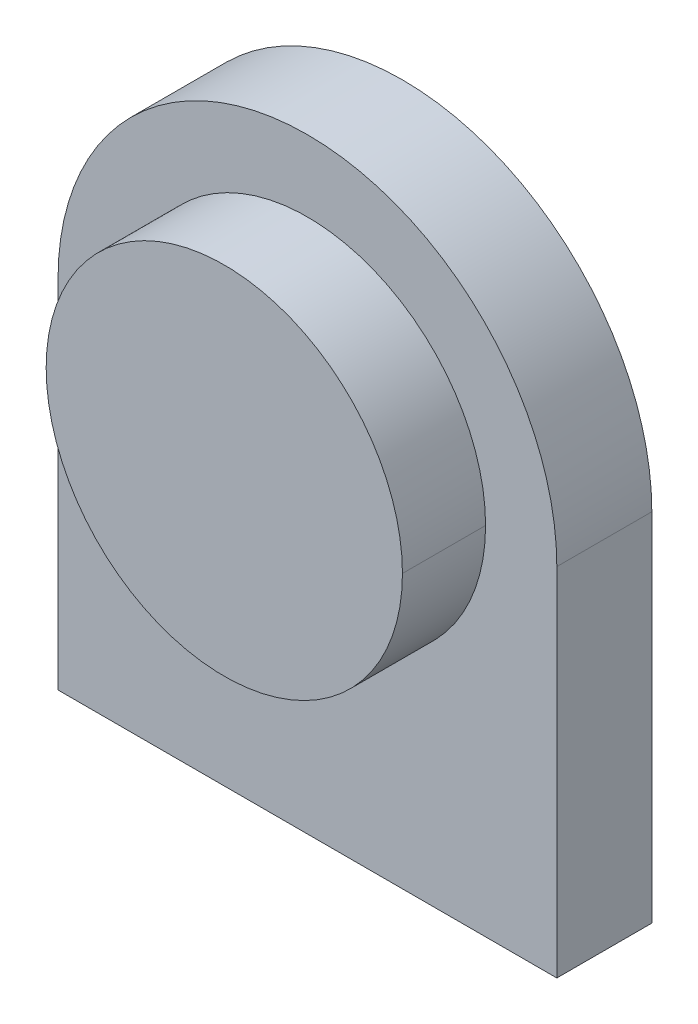
ISO-10303-21;
HEADER;
FILE_DESCRIPTION(('STEP AP214'),'2;1');
FILE_NAME('part.step','',(''),(''),'','','');
FILE_SCHEMA(('AUTOMOTIVE_DESIGN { 1 0 10303 214 1 1 1 1 }'));
ENDSEC;
DATA;
#1=APPLICATION_CONTEXT('core data for automotive mechanical design processes');
#2=APPLICATION_PROTOCOL_DEFINITION('international standard','automotive_design',2000,#1);
#3=PRODUCT_CONTEXT('',#1,'mechanical');
#4=PRODUCT('Part','Part','',(#3));
#5=PRODUCT_RELATED_PRODUCT_CATEGORY('part','',(#4));
#6=PRODUCT_DEFINITION_FORMATION('','',#4);
#7=PRODUCT_DEFINITION_CONTEXT('part definition',#1,'design');
#8=PRODUCT_DEFINITION('design','',#6,#7);
#9=PRODUCT_DEFINITION_SHAPE('','',#8);
#10=(LENGTH_UNIT() NAMED_UNIT(*) SI_UNIT(.MILLI.,.METRE.));
#11=(NAMED_UNIT(*) PLANE_ANGLE_UNIT() SI_UNIT($,.RADIAN.));
#12=(NAMED_UNIT(*) SI_UNIT($,.STERADIAN.) SOLID_ANGLE_UNIT());
#13=UNCERTAINTY_MEASURE_WITH_UNIT(LENGTH_MEASURE(1.E-05),#10,'distance_accuracy_value','');
#14=(GEOMETRIC_REPRESENTATION_CONTEXT(3) GLOBAL_UNCERTAINTY_ASSIGNED_CONTEXT((#13)) GLOBAL_UNIT_ASSIGNED_CONTEXT((#10,
#11,#12)) REPRESENTATION_CONTEXT('',''));
#15=CARTESIAN_POINT('',(0.,0.,0.));
#16=DIRECTION('',(0.,0.,1.));
#17=DIRECTION('',(1.,0.,0.));
#18=AXIS2_PLACEMENT_3D('',#15,#16,#17);
#19=CARTESIAN_POINT('',(0.,0.,5.));
#20=DIRECTION('',(0.,0.,-1.));
#21=DIRECTION('',(-1.,0.,0.));
#22=AXIS2_PLACEMENT_3D('',#19,#20,#21);
#23=CYLINDRICAL_SURFACE('',#22,7.5);
#24=DIRECTION('',(0.,0.,-1.));
#25=VECTOR('',#24,1.);
#26=CARTESIAN_POINT('',(-7.5,0.,5.));
#27=LINE('',#26,#25);
#28=CARTESIAN_POINT('',(-7.5,0.,3.5));
#29=VERTEX_POINT('',#28);
#30=CARTESIAN_POINT('',(-7.5,0.,0.));
#31=VERTEX_POINT('',#30);
#32=EDGE_CURVE('E167',#29,#31,#27,.T.);
#33=ORIENTED_EDGE('',*,*,#32,.F.);
#34=CARTESIAN_POINT('',(0.,0.,3.5));
#35=DIRECTION('',(0.,0.,1.));
#36=DIRECTION('',(1.,0.,0.));
#37=AXIS2_PLACEMENT_3D('',#34,#35,#36);
#38=CIRCLE('',#37,7.5);
#39=CARTESIAN_POINT('',(7.5,0.,3.5));
#40=VERTEX_POINT('',#39);
#41=EDGE_CURVE('E68',#40,#29,#38,.T.);
#42=ORIENTED_EDGE('',*,*,#41,.F.);
#43=DIRECTION('',(0.,0.,-1.));
#44=VECTOR('',#43,1.);
#45=CARTESIAN_POINT('',(7.5,0.,5.));
#46=LINE('',#45,#44);
#47=CARTESIAN_POINT('',(7.5,0.,0.));
#48=VERTEX_POINT('',#47);
#49=EDGE_CURVE('E101',#40,#48,#46,.T.);
#50=ORIENTED_EDGE('',*,*,#49,.T.);
#51=CARTESIAN_POINT('',(0.,0.,0.));
#52=DIRECTION('',(0.,0.,1.));
#53=DIRECTION('',(1.,0.,0.));
#54=AXIS2_PLACEMENT_3D('',#51,#52,#53);
#55=CIRCLE('',#54,7.5);
#56=EDGE_CURVE('E170',#48,#31,#55,.T.);
#57=ORIENTED_EDGE('',*,*,#56,.T.);
#58=EDGE_LOOP('',(#33,#42,#50,#57));
#59=FACE_BOUND('',#58,.T.);
#60=ADVANCED_FACE('F51',(#59),#23,.T.);
#61=CARTESIAN_POINT('',(0.,0.,5.));
#62=DIRECTION('',(0.,0.,-1.));
#63=DIRECTION('',(-1.,0.,0.));
#64=AXIS2_PLACEMENT_3D('',#61,#62,#63);
#65=CYLINDRICAL_SURFACE('',#64,7.5);
#66=ORIENTED_EDGE('',*,*,#49,.F.);
#67=EDGE_CURVE('E366',#29,#40,#38,.T.);
#68=ORIENTED_EDGE('',*,*,#67,.F.);
#69=ORIENTED_EDGE('',*,*,#32,.T.);
#70=CARTESIAN_POINT('',(0.,0.,0.));
#71=DIRECTION('',(0.,0.,1.));
#72=DIRECTION('',(1.,0.,0.));
#73=AXIS2_PLACEMENT_3D('',#70,#71,#72);
#74=CIRCLE('',#73,7.5);
#75=EDGE_CURVE('E125',#31,#48,#74,.T.);
#76=ORIENTED_EDGE('',*,*,#75,.T.);
#77=EDGE_LOOP('',(#66,#68,#69,#76));
#78=FACE_BOUND('',#77,.T.);
#79=ADVANCED_FACE('F269',(#78),#65,.T.);
#80=CARTESIAN_POINT('',(0.,0.,-4.));
#81=DIRECTION('',(0.,0.,1.));
#82=DIRECTION('',(1.,0.,0.));
#83=AXIS2_PLACEMENT_3D('',#80,#81,#82);
#84=CYLINDRICAL_SURFACE('',#83,10.5);
#85=CARTESIAN_POINT('',(0.,0.,-4.));
#86=DIRECTION('',(0.,0.,-1.));
#87=DIRECTION('',(-1.,0.,0.));
#88=AXIS2_PLACEMENT_3D('',#85,#86,#87);
#89=CIRCLE('',#88,10.5);
#90=CARTESIAN_POINT('',(-10.5,0.,-4.));
#91=VERTEX_POINT('',#90);
#92=CARTESIAN_POINT('',(10.5,0.,-4.));
#93=VERTEX_POINT('',#92);
#94=EDGE_CURVE('E55',#91,#93,#89,.T.);
#95=ORIENTED_EDGE('',*,*,#94,.F.);
#96=DIRECTION('',(0.,0.,1.));
#97=VECTOR('',#96,1.);
#98=CARTESIAN_POINT('',(-10.5,0.,-4.));
#99=LINE('',#98,#97);
#100=CARTESIAN_POINT('',(-10.5,0.,0.));
#101=VERTEX_POINT('',#100);
#102=EDGE_CURVE('E12',#91,#101,#99,.T.);
#103=ORIENTED_EDGE('',*,*,#102,.T.);
#104=CARTESIAN_POINT('',(0.,0.,0.));
#105=DIRECTION('',(0.,0.,-1.));
#106=DIRECTION('',(-1.,0.,0.));
#107=AXIS2_PLACEMENT_3D('',#104,#105,#106);
#108=CIRCLE('',#107,10.5);
#109=CARTESIAN_POINT('',(10.5,0.,0.));
#110=VERTEX_POINT('',#109);
#111=EDGE_CURVE('E61',#101,#110,#108,.T.);
#112=ORIENTED_EDGE('',*,*,#111,.T.);
#113=DIRECTION('',(0.,0.,1.));
#114=VECTOR('',#113,1.);
#115=CARTESIAN_POINT('',(10.5,0.,-4.));
#116=LINE('',#115,#114);
#117=EDGE_CURVE('E116',#93,#110,#116,.T.);
#118=ORIENTED_EDGE('',*,*,#117,.F.);
#119=EDGE_LOOP('',(#95,#103,#112,#118));
#120=FACE_BOUND('',#119,.T.);
#121=ADVANCED_FACE('F119',(#120),#84,.T.);
#122=CARTESIAN_POINT('',(0.,0.,-4.));
#123=DIRECTION('',(0.,0.,-1.));
#124=DIRECTION('',(0.,-1.,0.));
#125=AXIS2_PLACEMENT_3D('',#122,#123,#124);
#126=PLANE('',#125);
#127=CARTESIAN_POINT('',(0.,0.,-4.));
#128=DIRECTION('',(0.,0.,-1.));
#129=DIRECTION('',(0.,1.,0.));
#130=AXIS2_PLACEMENT_3D('',#127,#128,#129);
#131=CIRCLE('',#130,9.25);
#132=CARTESIAN_POINT('',(0.,9.25,-4.));
#133=VERTEX_POINT('',#132);
#134=EDGE_CURVE('E155',#133,#133,#131,.T.);
#135=ORIENTED_EDGE('',*,*,#134,.F.);
#136=EDGE_LOOP('',(#135));
#137=FACE_BOUND('',#136,.T.);
#138=ORIENTED_EDGE('',*,*,#94,.T.);
#139=DIRECTION('',(0.,1.,0.));
#140=VECTOR('',#139,1.);
#141=CARTESIAN_POINT('',(10.5,0.,-4.));
#142=LINE('',#141,#140);
#143=CARTESIAN_POINT('',(10.5,-15.,-4.));
#144=VERTEX_POINT('',#143);
#145=EDGE_CURVE('E111',#144,#93,#142,.T.);
#146=ORIENTED_EDGE('',*,*,#145,.F.);
#147=DIRECTION('',(-1.,0.,0.));
#148=VECTOR('',#147,1.);
#149=CARTESIAN_POINT('',(0.,-15.,-4.));
#150=LINE('',#149,#148);
#151=CARTESIAN_POINT('',(-10.5,-15.,-4.));
#152=VERTEX_POINT('',#151);
#153=EDGE_CURVE('E134',#144,#152,#150,.T.);
#154=ORIENTED_EDGE('',*,*,#153,.T.);
#155=DIRECTION('',(0.,1.,0.));
#156=VECTOR('',#155,1.);
#157=CARTESIAN_POINT('',(-10.5,0.,-4.));
#158=LINE('',#157,#156);
#159=EDGE_CURVE('E113',#152,#91,#158,.T.);
#160=ORIENTED_EDGE('',*,*,#159,.T.);
#161=EDGE_LOOP('',(#138,#146,#154,#160));
#162=FACE_BOUND('',#161,.T.);
#163=ADVANCED_FACE('F108',(#137,#162),#126,.T.);
#164=CARTESIAN_POINT('',(0.,0.,0.));
#165=DIRECTION('',(0.,0.,-1.));
#166=DIRECTION('',(0.,-1.,0.));
#167=AXIS2_PLACEMENT_3D('',#164,#165,#166);
#168=PLANE('',#167);
#169=ORIENTED_EDGE('',*,*,#111,.F.);
#170=DIRECTION('',(0.,1.,0.));
#171=VECTOR('',#170,1.);
#172=CARTESIAN_POINT('',(-10.5,0.,0.));
#173=LINE('',#172,#171);
#174=CARTESIAN_POINT('',(-10.5,-15.,0.));
#175=VERTEX_POINT('',#174);
#176=EDGE_CURVE('E143',#175,#101,#173,.T.);
#177=ORIENTED_EDGE('',*,*,#176,.F.);
#178=DIRECTION('',(-1.,0.,0.));
#179=VECTOR('',#178,1.);
#180=CARTESIAN_POINT('',(0.,-15.,0.));
#181=LINE('',#180,#179);
#182=CARTESIAN_POINT('',(10.5,-15.,0.));
#183=VERTEX_POINT('',#182);
#184=EDGE_CURVE('E147',#183,#175,#181,.T.);
#185=ORIENTED_EDGE('',*,*,#184,.F.);
#186=DIRECTION('',(0.,1.,0.));
#187=VECTOR('',#186,1.);
#188=CARTESIAN_POINT('',(10.5,0.,0.));
#189=LINE('',#188,#187);
#190=EDGE_CURVE('E151',#183,#110,#189,.T.);
#191=ORIENTED_EDGE('',*,*,#190,.T.);
#192=EDGE_LOOP('',(#169,#177,#185,#191));
#193=FACE_BOUND('',#192,.T.);
#194=ORIENTED_EDGE('',*,*,#75,.F.);
#195=ORIENTED_EDGE('',*,*,#56,.F.);
#196=EDGE_LOOP('',(#194,#195));
#197=FACE_BOUND('',#196,.T.);
#198=ADVANCED_FACE('F209',(#193,#197),#168,.F.);
#199=CARTESIAN_POINT('',(0.,0.,-4.));
#200=DIRECTION('',(0.,0.,-1.));
#201=DIRECTION('',(0.,1.,0.));
#202=AXIS2_PLACEMENT_3D('',#199,#200,#201);
#203=CONICAL_SURFACE('',#202,9.25,0.785398163397449);
#204=CARTESIAN_POINT('',(0.,0.,-3.25));
#205=DIRECTION('',(0.,0.,-1.));
#206=DIRECTION('',(0.,1.,0.));
#207=AXIS2_PLACEMENT_3D('',#204,#205,#206);
#208=CIRCLE('',#207,8.5);
#209=CARTESIAN_POINT('',(0.,8.5,-3.25));
#210=VERTEX_POINT('',#209);
#211=EDGE_CURVE('E160',#210,#210,#208,.T.);
#212=ORIENTED_EDGE('',*,*,#211,.F.);
#213=EDGE_LOOP('',(#212));
#214=FACE_BOUND('',#213,.T.);
#215=ORIENTED_EDGE('',*,*,#134,.T.);
#216=EDGE_LOOP('',(#215));
#217=FACE_BOUND('',#216,.T.);
#218=ADVANCED_FACE('F205',(#214,#217),#203,.F.);
#219=CARTESIAN_POINT('',(0.,0.,-1.));
#220=DIRECTION('',(0.,0.,-1.));
#221=DIRECTION('',(0.,-1.,0.));
#222=AXIS2_PLACEMENT_3D('',#219,#220,#221);
#223=PLANE('',#222);
#224=CARTESIAN_POINT('',(0.,0.,-1.));
#225=DIRECTION('',(0.,0.,-1.));
#226=DIRECTION('',(-1.,0.,0.));
#227=AXIS2_PLACEMENT_3D('',#224,#225,#226);
#228=CIRCLE('',#227,8.5);
#229=CARTESIAN_POINT('',(-8.5,0.,-1.));
#230=VERTEX_POINT('',#229);
#231=EDGE_CURVE('E117',#230,#230,#228,.T.);
#232=ORIENTED_EDGE('',*,*,#231,.T.);
#233=EDGE_LOOP('',(#232));
#234=FACE_BOUND('',#233,.T.);
#235=ADVANCED_FACE('F53',(#234),#223,.T.);
#236=CARTESIAN_POINT('',(0.,0.,-1.));
#237=DIRECTION('',(0.,0.,-1.));
#238=DIRECTION('',(-1.,0.,0.));
#239=AXIS2_PLACEMENT_3D('',#236,#237,#238);
#240=CYLINDRICAL_SURFACE('',#239,8.5);
#241=ORIENTED_EDGE('',*,*,#211,.T.);
#242=EDGE_LOOP('',(#241));
#243=FACE_BOUND('',#242,.T.);
#244=ORIENTED_EDGE('',*,*,#231,.F.);
#245=EDGE_LOOP('',(#244));
#246=FACE_BOUND('',#245,.T.);
#247=ADVANCED_FACE('F218',(#243,#246),#240,.F.);
#248=CARTESIAN_POINT('',(-10.5,0.,-4.));
#249=DIRECTION('',(1.,0.,0.));
#250=DIRECTION('',(0.,0.,-1.));
#251=AXIS2_PLACEMENT_3D('',#248,#249,#250);
#252=PLANE('',#251);
#253=ORIENTED_EDGE('',*,*,#176,.T.);
#254=ORIENTED_EDGE('',*,*,#102,.F.);
#255=ORIENTED_EDGE('',*,*,#159,.F.);
#256=DIRECTION('',(0.,0.,1.));
#257=VECTOR('',#256,1.);
#258=CARTESIAN_POINT('',(-10.5,-15.,-4.));
#259=LINE('',#258,#257);
#260=EDGE_CURVE('E133',#152,#175,#259,.T.);
#261=ORIENTED_EDGE('',*,*,#260,.T.);
#262=EDGE_LOOP('',(#253,#254,#255,#261));
#263=FACE_BOUND('',#262,.T.);
#264=ADVANCED_FACE('F224',(#263),#252,.F.);
#265=CARTESIAN_POINT('',(10.5,0.,-4.));
#266=DIRECTION('',(1.,0.,0.));
#267=DIRECTION('',(0.,1.,0.));
#268=AXIS2_PLACEMENT_3D('',#265,#266,#267);
#269=PLANE('',#268);
#270=ORIENTED_EDGE('',*,*,#190,.F.);
#271=DIRECTION('',(0.,0.,1.));
#272=VECTOR('',#271,1.);
#273=CARTESIAN_POINT('',(10.5,-15.,-4.));
#274=LINE('',#273,#272);
#275=EDGE_CURVE('E130',#144,#183,#274,.T.);
#276=ORIENTED_EDGE('',*,*,#275,.F.);
#277=ORIENTED_EDGE('',*,*,#145,.T.);
#278=ORIENTED_EDGE('',*,*,#117,.T.);
#279=EDGE_LOOP('',(#270,#276,#277,#278));
#280=FACE_BOUND('',#279,.T.);
#281=ADVANCED_FACE('F128',(#280),#269,.T.);
#282=CARTESIAN_POINT('',(0.,-15.,-4.));
#283=DIRECTION('',(0.,1.,0.));
#284=DIRECTION('',(-1.,0.,0.));
#285=AXIS2_PLACEMENT_3D('',#282,#283,#284);
#286=PLANE('',#285);
#287=ORIENTED_EDGE('',*,*,#184,.T.);
#288=ORIENTED_EDGE('',*,*,#260,.F.);
#289=ORIENTED_EDGE('',*,*,#153,.F.);
#290=ORIENTED_EDGE('',*,*,#275,.T.);
#291=EDGE_LOOP('',(#287,#288,#289,#290));
#292=FACE_BOUND('',#291,.T.);
#293=ADVANCED_FACE('F254',(#292),#286,.F.);
#294=CARTESIAN_POINT('',(0.,0.,3.5));
#295=DIRECTION('',(0.,0.,1.));
#296=DIRECTION('',(1.,0.,0.));
#297=AXIS2_PLACEMENT_3D('',#294,#295,#296);
#298=PLANE('',#297);
#299=ORIENTED_EDGE('',*,*,#41,.T.);
#300=ORIENTED_EDGE('',*,*,#67,.T.);
#301=EDGE_LOOP('',(#299,#300));
#302=FACE_BOUND('',#301,.T.);
#303=ADVANCED_FACE('F260',(#302),#298,.T.);
#304=CLOSED_SHELL('',(#60,#79,#121,#163,#198,#218,#235,#247,#264,#281,#293,#303));
#305=MANIFOLD_SOLID_BREP('B2',#304);
#306=ADVANCED_BREP_SHAPE_REPRESENTATION('',(#18,#305),#14);
#307=SHAPE_DEFINITION_REPRESENTATION(#9,#306);
ENDSEC;
END-ISO-10303-21;
